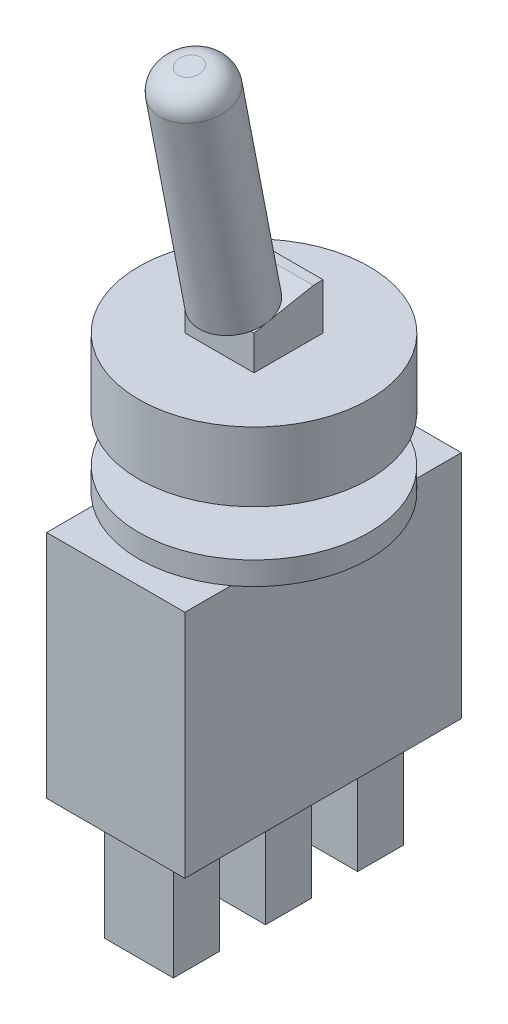
ISO-10303-21;
HEADER;
FILE_DESCRIPTION(('STEP AP214'),'2;1');
FILE_NAME('part.step','',(''),(''),'','','');
FILE_SCHEMA(('AUTOMOTIVE_DESIGN { 1 0 10303 214 1 1 1 1 }'));
ENDSEC;
DATA;
#1=APPLICATION_CONTEXT('core data for automotive mechanical design processes');
#2=APPLICATION_PROTOCOL_DEFINITION('international standard','automotive_design',2000,#1);
#3=PRODUCT_CONTEXT('',#1,'mechanical');
#4=PRODUCT('Part','Part','',(#3));
#5=PRODUCT_RELATED_PRODUCT_CATEGORY('part','',(#4));
#6=PRODUCT_DEFINITION_FORMATION('','',#4);
#7=PRODUCT_DEFINITION_CONTEXT('part definition',#1,'design');
#8=PRODUCT_DEFINITION('design','',#6,#7);
#9=PRODUCT_DEFINITION_SHAPE('','',#8);
#10=(LENGTH_UNIT() NAMED_UNIT(*) SI_UNIT(.MILLI.,.METRE.));
#11=(NAMED_UNIT(*) PLANE_ANGLE_UNIT() SI_UNIT($,.RADIAN.));
#12=(NAMED_UNIT(*) SI_UNIT($,.STERADIAN.) SOLID_ANGLE_UNIT());
#13=UNCERTAINTY_MEASURE_WITH_UNIT(LENGTH_MEASURE(1.E-05),#10,'distance_accuracy_value','');
#14=(GEOMETRIC_REPRESENTATION_CONTEXT(3) GLOBAL_UNCERTAINTY_ASSIGNED_CONTEXT((#13)) GLOBAL_UNIT_ASSIGNED_CONTEXT((#10,
#11,#12)) REPRESENTATION_CONTEXT('',''));
#15=CARTESIAN_POINT('',(0.,0.,0.));
#16=DIRECTION('',(0.,0.,1.));
#17=DIRECTION('',(1.,0.,0.));
#18=AXIS2_PLACEMENT_3D('',#15,#16,#17);
#19=CARTESIAN_POINT('',(-1.5,5.,-1.07227700798515));
#20=DIRECTION('',(0.,0.981627183447664,0.190808995376545));
#21=DIRECTION('',(0.,-0.190808995376545,0.981627183447664));
#22=AXIS2_PLACEMENT_3D('',#19,#20,#21);
#23=PLANE('',#22);
#24=CARTESIAN_POINT('',(0.,4.61711861783721,0.897476944260715));
#25=DIRECTION('',(0.,0.981627183447664,0.190808995376545));
#26=DIRECTION('',(0.,-0.190808995376545,0.981627183447664));
#27=AXIS2_PLACEMENT_3D('',#24,#25,#26);
#28=CIRCLE('',#27,1.5);
#29=CARTESIAN_POINT('',(1.36866694146476,4.5,1.5));
#30=VERTEX_POINT('',#29);
#31=CARTESIAN_POINT('',(1.5,4.61711861783721,0.897476944260715));
#32=VERTEX_POINT('',#31);
#33=EDGE_CURVE('E52',#30,#32,#28,.T.);
#34=ORIENTED_EDGE('',*,*,#33,.F.);
#35=DIRECTION('',(-1.,0.,0.));
#36=VECTOR('',#35,1.);
#37=CARTESIAN_POINT('',(-1.5,4.5,1.5));
#38=LINE('',#37,#36);
#39=CARTESIAN_POINT('',(1.5,4.5,1.5));
#40=VERTEX_POINT('',#39);
#41=EDGE_CURVE('E204',#40,#30,#38,.T.);
#42=ORIENTED_EDGE('',*,*,#41,.F.);
#43=DIRECTION('',(0.,-0.190808995376545,0.981627183447664));
#44=VECTOR('',#43,1.);
#45=CARTESIAN_POINT('',(1.5,5.,-1.07227700798515));
#46=LINE('',#45,#44);
#47=EDGE_CURVE('E400',#32,#40,#46,.T.);
#48=ORIENTED_EDGE('',*,*,#47,.F.);
#49=EDGE_LOOP('',(#34,#42,#48));
#50=FACE_BOUND('',#49,.T.);
#51=ADVANCED_FACE('F30',(#50),#23,.T.);
#52=CARTESIAN_POINT('',(-1.5,4.61711861783721,0.897476944260715));
#53=VERTEX_POINT('',#52);
#54=EDGE_CURVE('E45',#32,#53,#28,.T.);
#55=ORIENTED_EDGE('',*,*,#54,.F.);
#56=CARTESIAN_POINT('',(1.5,5.,-1.07227700798515));
#57=VERTEX_POINT('',#56);
#58=EDGE_CURVE('E216',#57,#32,#46,.T.);
#59=ORIENTED_EDGE('',*,*,#58,.F.);
#60=DIRECTION('',(1.,0.,0.));
#61=VECTOR('',#60,1.);
#62=CARTESIAN_POINT('',(1.5,5.,-1.07227700798515));
#63=LINE('',#62,#61);
#64=CARTESIAN_POINT('',(-1.5,5.,-1.07227700798515));
#65=VERTEX_POINT('',#64);
#66=EDGE_CURVE('E397',#65,#57,#63,.T.);
#67=ORIENTED_EDGE('',*,*,#66,.F.);
#68=DIRECTION('',(0.,0.190808995376545,-0.981627183447664));
#69=VECTOR('',#68,1.);
#70=CARTESIAN_POINT('',(-1.5,5.,-1.07227700798515));
#71=LINE('',#70,#69);
#72=EDGE_CURVE('E222',#53,#65,#71,.T.);
#73=ORIENTED_EDGE('',*,*,#72,.F.);
#74=EDGE_LOOP('',(#55,#59,#67,#73));
#75=FACE_BOUND('',#74,.T.);
#76=ADVANCED_FACE('F417',(#75),#23,.T.);
#77=CARTESIAN_POINT('',(0.,3.,0.));
#78=DIRECTION('',(0.,1.,0.));
#79=DIRECTION('',(0.,0.,1.));
#80=AXIS2_PLACEMENT_3D('',#77,#78,#79);
#81=PLANE('',#80);
#82=CARTESIAN_POINT('',(0.,3.,0.));
#83=DIRECTION('',(0.,1.,0.));
#84=DIRECTION('',(0.,0.,1.));
#85=AXIS2_PLACEMENT_3D('',#82,#83,#84);
#86=CIRCLE('',#85,5.);
#87=CARTESIAN_POINT('',(0.,3.,5.));
#88=VERTEX_POINT('',#87);
#89=EDGE_CURVE('E391',#88,#88,#86,.T.);
#90=ORIENTED_EDGE('',*,*,#89,.T.);
#91=EDGE_LOOP('',(#90));
#92=FACE_BOUND('',#91,.T.);
#93=DIRECTION('',(1.,0.,0.));
#94=VECTOR('',#93,1.);
#95=CARTESIAN_POINT('',(-1.5,3.,1.5));
#96=LINE('',#95,#94);
#97=CARTESIAN_POINT('',(-1.5,3.,1.5));
#98=VERTEX_POINT('',#97);
#99=CARTESIAN_POINT('',(1.5,3.,1.5));
#100=VERTEX_POINT('',#99);
#101=EDGE_CURVE('E227',#98,#100,#96,.T.);
#102=ORIENTED_EDGE('',*,*,#101,.F.);
#103=DIRECTION('',(0.,0.,1.));
#104=VECTOR('',#103,1.);
#105=CARTESIAN_POINT('',(-1.5,3.,-1.5));
#106=LINE('',#105,#104);
#107=CARTESIAN_POINT('',(-1.5,3.,-1.5));
#108=VERTEX_POINT('',#107);
#109=EDGE_CURVE('E225',#108,#98,#106,.T.);
#110=ORIENTED_EDGE('',*,*,#109,.F.);
#111=DIRECTION('',(-1.,0.,0.));
#112=VECTOR('',#111,1.);
#113=CARTESIAN_POINT('',(-1.5,3.,-1.5));
#114=LINE('',#113,#112);
#115=CARTESIAN_POINT('',(1.5,3.,-1.5));
#116=VERTEX_POINT('',#115);
#117=EDGE_CURVE('E238',#116,#108,#114,.T.);
#118=ORIENTED_EDGE('',*,*,#117,.F.);
#119=DIRECTION('',(0.,0.,-1.));
#120=VECTOR('',#119,1.);
#121=CARTESIAN_POINT('',(1.5,3.,-1.5));
#122=LINE('',#121,#120);
#123=EDGE_CURVE('E233',#100,#116,#122,.T.);
#124=ORIENTED_EDGE('',*,*,#123,.F.);
#125=EDGE_LOOP('',(#102,#110,#118,#124));
#126=FACE_BOUND('',#125,.T.);
#127=ADVANCED_FACE('F422',(#92,#126),#81,.T.);
#128=CARTESIAN_POINT('',(3.,-13.,-6.));
#129=DIRECTION('',(0.,-1.,0.));
#130=DIRECTION('',(0.,0.,-1.));
#131=AXIS2_PLACEMENT_3D('',#128,#129,#130);
#132=PLANE('',#131);
#133=DIRECTION('',(1.,0.,0.));
#134=VECTOR('',#133,1.);
#135=CARTESIAN_POINT('',(-1.5,-13.,-1.));
#136=LINE('',#135,#134);
#137=CARTESIAN_POINT('',(-1.5,-13.,-1.));
#138=VERTEX_POINT('',#137);
#139=CARTESIAN_POINT('',(1.5,-13.,-1.));
#140=VERTEX_POINT('',#139);
#141=EDGE_CURVE('E287',#138,#140,#136,.T.);
#142=ORIENTED_EDGE('',*,*,#141,.F.);
#143=DIRECTION('',(0.,0.,-1.));
#144=VECTOR('',#143,1.);
#145=CARTESIAN_POINT('',(-1.5,-13.,-1.));
#146=LINE('',#145,#144);
#147=CARTESIAN_POINT('',(-1.5,-13.,1.));
#148=VERTEX_POINT('',#147);
#149=EDGE_CURVE('E284',#148,#138,#146,.T.);
#150=ORIENTED_EDGE('',*,*,#149,.F.);
#151=DIRECTION('',(-1.,0.,0.));
#152=VECTOR('',#151,1.);
#153=CARTESIAN_POINT('',(-1.5,-13.,1.));
#154=LINE('',#153,#152);
#155=CARTESIAN_POINT('',(1.5,-13.,1.));
#156=VERTEX_POINT('',#155);
#157=EDGE_CURVE('E292',#156,#148,#154,.T.);
#158=ORIENTED_EDGE('',*,*,#157,.F.);
#159=DIRECTION('',(0.,0.,1.));
#160=VECTOR('',#159,1.);
#161=CARTESIAN_POINT('',(1.5,-13.,-1.));
#162=LINE('',#161,#160);
#163=EDGE_CURVE('E289',#140,#156,#162,.T.);
#164=ORIENTED_EDGE('',*,*,#163,.F.);
#165=EDGE_LOOP('',(#142,#150,#158,#164));
#166=FACE_BOUND('',#165,.T.);
#167=DIRECTION('',(0.,0.,1.));
#168=VECTOR('',#167,1.);
#169=CARTESIAN_POINT('',(3.,-13.,-6.));
#170=LINE('',#169,#168);
#171=CARTESIAN_POINT('',(3.,-13.,-6.));
#172=VERTEX_POINT('',#171);
#173=CARTESIAN_POINT('',(3.,-13.,6.));
#174=VERTEX_POINT('',#173);
#175=EDGE_CURVE('E356',#172,#174,#170,.T.);
#176=ORIENTED_EDGE('',*,*,#175,.T.);
#177=DIRECTION('',(-1.,0.,0.));
#178=VECTOR('',#177,1.);
#179=CARTESIAN_POINT('',(3.,-13.,6.));
#180=LINE('',#179,#178);
#181=CARTESIAN_POINT('',(-3.,-13.,6.));
#182=VERTEX_POINT('',#181);
#183=EDGE_CURVE('E359',#174,#182,#180,.T.);
#184=ORIENTED_EDGE('',*,*,#183,.T.);
#185=DIRECTION('',(0.,0.,-1.));
#186=VECTOR('',#185,1.);
#187=CARTESIAN_POINT('',(-3.,-13.,-6.));
#188=LINE('',#187,#186);
#189=CARTESIAN_POINT('',(-3.,-13.,-6.));
#190=VERTEX_POINT('',#189);
#191=EDGE_CURVE('E361',#182,#190,#188,.T.);
#192=ORIENTED_EDGE('',*,*,#191,.T.);
#193=DIRECTION('',(1.,0.,0.));
#194=VECTOR('',#193,1.);
#195=CARTESIAN_POINT('',(3.,-13.,-6.));
#196=LINE('',#195,#194);
#197=EDGE_CURVE('E363',#190,#172,#196,.T.);
#198=ORIENTED_EDGE('',*,*,#197,.T.);
#199=EDGE_LOOP('',(#176,#184,#192,#198));
#200=FACE_BOUND('',#199,.T.);
#201=DIRECTION('',(1.,0.,0.));
#202=VECTOR('',#201,1.);
#203=CARTESIAN_POINT('',(-1.5,-13.,3.));
#204=LINE('',#203,#202);
#205=CARTESIAN_POINT('',(-1.5,-13.,3.));
#206=VERTEX_POINT('',#205);
#207=CARTESIAN_POINT('',(1.5,-13.,3.));
#208=VERTEX_POINT('',#207);
#209=EDGE_CURVE('E316',#206,#208,#204,.T.);
#210=ORIENTED_EDGE('',*,*,#209,.F.);
#211=DIRECTION('',(0.,0.,-1.));
#212=VECTOR('',#211,1.);
#213=CARTESIAN_POINT('',(-1.5,-13.,3.));
#214=LINE('',#213,#212);
#215=CARTESIAN_POINT('',(-1.5,-13.,5.));
#216=VERTEX_POINT('',#215);
#217=EDGE_CURVE('E313',#216,#206,#214,.T.);
#218=ORIENTED_EDGE('',*,*,#217,.F.);
#219=DIRECTION('',(-1.,0.,0.));
#220=VECTOR('',#219,1.);
#221=CARTESIAN_POINT('',(-1.5,-13.,5.));
#222=LINE('',#221,#220);
#223=CARTESIAN_POINT('',(1.5,-13.,5.));
#224=VERTEX_POINT('',#223);
#225=EDGE_CURVE('E321',#224,#216,#222,.T.);
#226=ORIENTED_EDGE('',*,*,#225,.F.);
#227=DIRECTION('',(0.,0.,1.));
#228=VECTOR('',#227,1.);
#229=CARTESIAN_POINT('',(1.5,-13.,3.));
#230=LINE('',#229,#228);
#231=EDGE_CURVE('E318',#208,#224,#230,.T.);
#232=ORIENTED_EDGE('',*,*,#231,.F.);
#233=EDGE_LOOP('',(#210,#218,#226,#232));
#234=FACE_BOUND('',#233,.T.);
#235=DIRECTION('',(1.,0.,0.));
#236=VECTOR('',#235,1.);
#237=CARTESIAN_POINT('',(-1.5,-13.,-5.));
#238=LINE('',#237,#236);
#239=CARTESIAN_POINT('',(-1.5,-13.,-5.));
#240=VERTEX_POINT('',#239);
#241=CARTESIAN_POINT('',(1.5,-13.,-5.));
#242=VERTEX_POINT('',#241);
#243=EDGE_CURVE('E258',#240,#242,#238,.T.);
#244=ORIENTED_EDGE('',*,*,#243,.F.);
#245=DIRECTION('',(0.,0.,-1.));
#246=VECTOR('',#245,1.);
#247=CARTESIAN_POINT('',(-1.5,-13.,-5.));
#248=LINE('',#247,#246);
#249=CARTESIAN_POINT('',(-1.5,-13.,-3.));
#250=VERTEX_POINT('',#249);
#251=EDGE_CURVE('E255',#250,#240,#248,.T.);
#252=ORIENTED_EDGE('',*,*,#251,.F.);
#253=DIRECTION('',(-1.,0.,0.));
#254=VECTOR('',#253,1.);
#255=CARTESIAN_POINT('',(-1.5,-13.,-3.));
#256=LINE('',#255,#254);
#257=CARTESIAN_POINT('',(1.5,-13.,-3.));
#258=VERTEX_POINT('',#257);
#259=EDGE_CURVE('E263',#258,#250,#256,.T.);
#260=ORIENTED_EDGE('',*,*,#259,.F.);
#261=DIRECTION('',(0.,0.,1.));
#262=VECTOR('',#261,1.);
#263=CARTESIAN_POINT('',(1.5,-13.,-5.));
#264=LINE('',#263,#262);
#265=EDGE_CURVE('E260',#242,#258,#264,.T.);
#266=ORIENTED_EDGE('',*,*,#265,.F.);
#267=EDGE_LOOP('',(#244,#252,#260,#266));
#268=FACE_BOUND('',#267,.T.);
#269=ADVANCED_FACE('F516',(#166,#200,#234,#268),#132,.T.);
#270=CARTESIAN_POINT('',(0.,-3.,0.));
#271=DIRECTION('',(0.,-1.,0.));
#272=DIRECTION('',(0.,0.,-1.));
#273=AXIS2_PLACEMENT_3D('',#270,#271,#272);
#274=PLANE('',#273);
#275=DIRECTION('',(0.,0.,1.));
#276=VECTOR('',#275,1.);
#277=CARTESIAN_POINT('',(3.,-3.,-6.));
#278=LINE('',#277,#276);
#279=CARTESIAN_POINT('',(3.,-3.,-4.));
#280=VERTEX_POINT('',#279);
#281=CARTESIAN_POINT('',(3.,-3.,4.));
#282=VERTEX_POINT('',#281);
#283=EDGE_CURVE('E347',#280,#282,#278,.T.);
#284=ORIENTED_EDGE('',*,*,#283,.F.);
#285=CARTESIAN_POINT('',(0.,-3.,0.));
#286=DIRECTION('',(0.,-1.,0.));
#287=DIRECTION('',(0.,0.,-1.));
#288=AXIS2_PLACEMENT_3D('',#285,#286,#287);
#289=CIRCLE('',#288,5.);
#290=EDGE_CURVE('E381',#280,#282,#289,.T.);
#291=ORIENTED_EDGE('',*,*,#290,.T.);
#292=EDGE_LOOP('',(#284,#291));
#293=FACE_BOUND('',#292,.T.);
#294=ADVANCED_FACE('F519',(#293),#274,.T.);
#295=CARTESIAN_POINT('',(0.,0.,0.));
#296=DIRECTION('',(0.,1.,0.));
#297=DIRECTION('',(0.,0.,1.));
#298=AXIS2_PLACEMENT_3D('',#295,#296,#297);
#299=PLANE('',#298);
#300=CARTESIAN_POINT('',(0.,0.,0.));
#301=DIRECTION('',(0.,1.,0.));
#302=DIRECTION('',(0.,0.,1.));
#303=AXIS2_PLACEMENT_3D('',#300,#301,#302);
#304=CIRCLE('',#303,5.);
#305=CARTESIAN_POINT('',(0.,0.,5.));
#306=VERTEX_POINT('',#305);
#307=EDGE_CURVE('E388',#306,#306,#304,.T.);
#308=ORIENTED_EDGE('',*,*,#307,.F.);
#309=EDGE_LOOP('',(#308));
#310=FACE_BOUND('',#309,.T.);
#311=CARTESIAN_POINT('',(0.,0.,0.));
#312=DIRECTION('',(0.,1.,0.));
#313=DIRECTION('',(0.,0.,1.));
#314=AXIS2_PLACEMENT_3D('',#311,#312,#313);
#315=CIRCLE('',#314,2.);
#316=CARTESIAN_POINT('',(0.,0.,2.));
#317=VERTEX_POINT('',#316);
#318=EDGE_CURVE('E394',#317,#317,#315,.F.);
#319=ORIENTED_EDGE('',*,*,#318,.F.);
#320=EDGE_LOOP('',(#319));
#321=FACE_BOUND('',#320,.T.);
#322=ADVANCED_FACE('F551',(#310,#321),#299,.F.);
#323=CARTESIAN_POINT('',(0.,3.,0.));
#324=DIRECTION('',(0.,-1.,0.));
#325=DIRECTION('',(0.,0.,-1.));
#326=AXIS2_PLACEMENT_3D('',#323,#324,#325);
#327=CYLINDRICAL_SURFACE('',#326,5.);
#328=ORIENTED_EDGE('',*,*,#89,.F.);
#329=EDGE_LOOP('',(#328));
#330=FACE_BOUND('',#329,.T.);
#331=ORIENTED_EDGE('',*,*,#307,.T.);
#332=EDGE_LOOP('',(#331));
#333=FACE_BOUND('',#332,.T.);
#334=ADVANCED_FACE('F32',(#330,#333),#327,.T.);
#335=CARTESIAN_POINT('',(0.,-2.,0.));
#336=DIRECTION('',(0.,1.,0.));
#337=DIRECTION('',(0.,0.,1.));
#338=AXIS2_PLACEMENT_3D('',#335,#336,#337);
#339=CYLINDRICAL_SURFACE('',#338,2.);
#340=CARTESIAN_POINT('',(0.,-2.,0.));
#341=DIRECTION('',(0.,-1.,0.));
#342=DIRECTION('',(0.,0.,-1.));
#343=AXIS2_PLACEMENT_3D('',#340,#341,#342);
#344=CIRCLE('',#343,2.);
#345=CARTESIAN_POINT('',(0.,-2.,-2.));
#346=VERTEX_POINT('',#345);
#347=EDGE_CURVE('E384',#346,#346,#344,.T.);
#348=ORIENTED_EDGE('',*,*,#347,.F.);
#349=EDGE_LOOP('',(#348));
#350=FACE_BOUND('',#349,.T.);
#351=ORIENTED_EDGE('',*,*,#318,.T.);
#352=EDGE_LOOP('',(#351));
#353=FACE_BOUND('',#352,.T.);
#354=ADVANCED_FACE('F540',(#350,#353),#339,.T.);
#355=CARTESIAN_POINT('',(0.,-2.,0.));
#356=DIRECTION('',(0.,-1.,0.));
#357=DIRECTION('',(0.,0.,-1.));
#358=AXIS2_PLACEMENT_3D('',#355,#356,#357);
#359=PLANE('',#358);
#360=CARTESIAN_POINT('',(0.,-2.,0.));
#361=DIRECTION('',(0.,-1.,0.));
#362=DIRECTION('',(0.,0.,-1.));
#363=AXIS2_PLACEMENT_3D('',#360,#361,#362);
#364=CIRCLE('',#363,5.);
#365=CARTESIAN_POINT('',(0.,-2.,-5.));
#366=VERTEX_POINT('',#365);
#367=EDGE_CURVE('E377',#366,#366,#364,.T.);
#368=ORIENTED_EDGE('',*,*,#367,.F.);
#369=EDGE_LOOP('',(#368));
#370=FACE_BOUND('',#369,.T.);
#371=ORIENTED_EDGE('',*,*,#347,.T.);
#372=EDGE_LOOP('',(#371));
#373=FACE_BOUND('',#372,.T.);
#374=ADVANCED_FACE('F536',(#370,#373),#359,.F.);
#375=CARTESIAN_POINT('',(0.,-3.,0.));
#376=DIRECTION('',(0.,1.,0.));
#377=DIRECTION('',(0.,0.,1.));
#378=AXIS2_PLACEMENT_3D('',#375,#376,#377);
#379=CYLINDRICAL_SURFACE('',#378,5.);
#380=ORIENTED_EDGE('',*,*,#290,.F.);
#381=CARTESIAN_POINT('',(-3.,-3.,-4.));
#382=VERTEX_POINT('',#381);
#383=EDGE_CURVE('E380',#382,#280,#289,.T.);
#384=ORIENTED_EDGE('',*,*,#383,.F.);
#385=CARTESIAN_POINT('',(-3.,-3.,4.));
#386=VERTEX_POINT('',#385);
#387=EDGE_CURVE('E835',#386,#382,#289,.T.);
#388=ORIENTED_EDGE('',*,*,#387,.F.);
#389=EDGE_CURVE('E385',#282,#386,#289,.T.);
#390=ORIENTED_EDGE('',*,*,#389,.F.);
#391=EDGE_LOOP('',(#380,#384,#388,#390));
#392=FACE_BOUND('',#391,.T.);
#393=ORIENTED_EDGE('',*,*,#367,.T.);
#394=EDGE_LOOP('',(#393));
#395=FACE_BOUND('',#394,.T.);
#396=ADVANCED_FACE('F539',(#392,#395),#379,.T.);
#397=DIRECTION('',(0.,0.,-1.));
#398=VECTOR('',#397,1.);
#399=CARTESIAN_POINT('',(-3.,-3.,-6.));
#400=LINE('',#399,#398);
#401=EDGE_CURVE('E354',#386,#382,#400,.T.);
#402=ORIENTED_EDGE('',*,*,#401,.F.);
#403=ORIENTED_EDGE('',*,*,#387,.T.);
#404=EDGE_LOOP('',(#402,#403));
#405=FACE_BOUND('',#404,.T.);
#406=ADVANCED_FACE('F514',(#405),#274,.T.);
#407=CARTESIAN_POINT('',(3.,-3.,-6.));
#408=DIRECTION('',(0.,-1.,0.));
#409=DIRECTION('',(0.,0.,-1.));
#410=AXIS2_PLACEMENT_3D('',#407,#408,#409);
#411=PLANE('',#410);
#412=CARTESIAN_POINT('',(3.,-3.,6.));
#413=VERTEX_POINT('',#412);
#414=EDGE_CURVE('E342',#282,#413,#278,.T.);
#415=ORIENTED_EDGE('',*,*,#414,.F.);
#416=ORIENTED_EDGE('',*,*,#389,.T.);
#417=CARTESIAN_POINT('',(-3.,-3.,6.));
#418=VERTEX_POINT('',#417);
#419=EDGE_CURVE('E350',#418,#386,#400,.T.);
#420=ORIENTED_EDGE('',*,*,#419,.F.);
#421=DIRECTION('',(-1.,0.,0.));
#422=VECTOR('',#421,1.);
#423=CARTESIAN_POINT('',(3.,-3.,6.));
#424=LINE('',#423,#422);
#425=EDGE_CURVE('E346',#413,#418,#424,.T.);
#426=ORIENTED_EDGE('',*,*,#425,.F.);
#427=EDGE_LOOP('',(#415,#416,#420,#426));
#428=FACE_BOUND('',#427,.T.);
#429=ADVANCED_FACE('F510',(#428),#411,.F.);
#430=CARTESIAN_POINT('',(-3.,-3.,-6.));
#431=VERTEX_POINT('',#430);
#432=EDGE_CURVE('E349',#382,#431,#400,.T.);
#433=ORIENTED_EDGE('',*,*,#432,.F.);
#434=ORIENTED_EDGE('',*,*,#383,.T.);
#435=CARTESIAN_POINT('',(3.,-3.,-6.));
#436=VERTEX_POINT('',#435);
#437=EDGE_CURVE('E343',#436,#280,#278,.T.);
#438=ORIENTED_EDGE('',*,*,#437,.F.);
#439=DIRECTION('',(1.,0.,0.));
#440=VECTOR('',#439,1.);
#441=CARTESIAN_POINT('',(3.,-3.,-6.));
#442=LINE('',#441,#440);
#443=EDGE_CURVE('E353',#431,#436,#442,.T.);
#444=ORIENTED_EDGE('',*,*,#443,.F.);
#445=EDGE_LOOP('',(#433,#434,#438,#444));
#446=FACE_BOUND('',#445,.T.);
#447=ADVANCED_FACE('F513',(#446),#411,.F.);
#448=CARTESIAN_POINT('',(3.,-13.,-6.));
#449=DIRECTION('',(-1.,0.,0.));
#450=DIRECTION('',(0.,0.,1.));
#451=AXIS2_PLACEMENT_3D('',#448,#449,#450);
#452=PLANE('',#451);
#453=ORIENTED_EDGE('',*,*,#437,.T.);
#454=ORIENTED_EDGE('',*,*,#283,.T.);
#455=ORIENTED_EDGE('',*,*,#414,.T.);
#456=DIRECTION('',(0.,1.,0.));
#457=VECTOR('',#456,1.);
#458=CARTESIAN_POINT('',(3.,-13.,6.));
#459=LINE('',#458,#457);
#460=EDGE_CURVE('E374',#174,#413,#459,.T.);
#461=ORIENTED_EDGE('',*,*,#460,.F.);
#462=ORIENTED_EDGE('',*,*,#175,.F.);
#463=DIRECTION('',(0.,1.,0.));
#464=VECTOR('',#463,1.);
#465=CARTESIAN_POINT('',(3.,-13.,-6.));
#466=LINE('',#465,#464);
#467=EDGE_CURVE('E365',#172,#436,#466,.T.);
#468=ORIENTED_EDGE('',*,*,#467,.T.);
#469=EDGE_LOOP('',(#453,#454,#455,#461,#462,#468));
#470=FACE_BOUND('',#469,.T.);
#471=ADVANCED_FACE('F531',(#470),#452,.F.);
#472=CARTESIAN_POINT('',(3.,-13.,6.));
#473=DIRECTION('',(0.,0.,-1.));
#474=DIRECTION('',(-1.,0.,0.));
#475=AXIS2_PLACEMENT_3D('',#472,#473,#474);
#476=PLANE('',#475);
#477=ORIENTED_EDGE('',*,*,#425,.T.);
#478=DIRECTION('',(0.,1.,0.));
#479=VECTOR('',#478,1.);
#480=CARTESIAN_POINT('',(-3.,-13.,6.));
#481=LINE('',#480,#479);
#482=EDGE_CURVE('E371',#182,#418,#481,.T.);
#483=ORIENTED_EDGE('',*,*,#482,.F.);
#484=ORIENTED_EDGE('',*,*,#183,.F.);
#485=ORIENTED_EDGE('',*,*,#460,.T.);
#486=EDGE_LOOP('',(#477,#483,#484,#485));
#487=FACE_BOUND('',#486,.T.);
#488=ADVANCED_FACE('F527',(#487),#476,.F.);
#489=CARTESIAN_POINT('',(-3.,-13.,-6.));
#490=DIRECTION('',(1.,0.,0.));
#491=DIRECTION('',(0.,0.,-1.));
#492=AXIS2_PLACEMENT_3D('',#489,#490,#491);
#493=PLANE('',#492);
#494=ORIENTED_EDGE('',*,*,#419,.T.);
#495=ORIENTED_EDGE('',*,*,#401,.T.);
#496=ORIENTED_EDGE('',*,*,#432,.T.);
#497=DIRECTION('',(0.,1.,0.));
#498=VECTOR('',#497,1.);
#499=CARTESIAN_POINT('',(-3.,-13.,-6.));
#500=LINE('',#499,#498);
#501=EDGE_CURVE('E368',#190,#431,#500,.T.);
#502=ORIENTED_EDGE('',*,*,#501,.F.);
#503=ORIENTED_EDGE('',*,*,#191,.F.);
#504=ORIENTED_EDGE('',*,*,#482,.T.);
#505=EDGE_LOOP('',(#494,#495,#496,#502,#503,#504));
#506=FACE_BOUND('',#505,.T.);
#507=ADVANCED_FACE('F523',(#506),#493,.F.);
#508=CARTESIAN_POINT('',(3.,-13.,-6.));
#509=DIRECTION('',(0.,0.,1.));
#510=DIRECTION('',(1.,0.,0.));
#511=AXIS2_PLACEMENT_3D('',#508,#509,#510);
#512=PLANE('',#511);
#513=ORIENTED_EDGE('',*,*,#443,.T.);
#514=ORIENTED_EDGE('',*,*,#467,.F.);
#515=ORIENTED_EDGE('',*,*,#197,.F.);
#516=ORIENTED_EDGE('',*,*,#501,.T.);
#517=EDGE_LOOP('',(#513,#514,#515,#516));
#518=FACE_BOUND('',#517,.T.);
#519=ADVANCED_FACE('F508',(#518),#512,.F.);
#520=CARTESIAN_POINT('',(-1.5,-18.,3.));
#521=DIRECTION('',(1.,0.,0.));
#522=DIRECTION('',(0.,0.,-1.));
#523=AXIS2_PLACEMENT_3D('',#520,#521,#522);
#524=PLANE('',#523);
#525=ORIENTED_EDGE('',*,*,#217,.T.);
#526=DIRECTION('',(0.,1.,0.));
#527=VECTOR('',#526,1.);
#528=CARTESIAN_POINT('',(-1.5,-18.,3.));
#529=LINE('',#528,#527);
#530=CARTESIAN_POINT('',(-1.5,-18.,3.));
#531=VERTEX_POINT('',#530);
#532=EDGE_CURVE('E340',#531,#206,#529,.T.);
#533=ORIENTED_EDGE('',*,*,#532,.F.);
#534=DIRECTION('',(0.,0.,-1.));
#535=VECTOR('',#534,1.);
#536=CARTESIAN_POINT('',(-1.5,-18.,3.));
#537=LINE('',#536,#535);
#538=CARTESIAN_POINT('',(-1.5,-18.,5.));
#539=VERTEX_POINT('',#538);
#540=EDGE_CURVE('E323',#539,#531,#537,.T.);
#541=ORIENTED_EDGE('',*,*,#540,.F.);
#542=DIRECTION('',(0.,1.,0.));
#543=VECTOR('',#542,1.);
#544=CARTESIAN_POINT('',(-1.5,-18.,5.));
#545=LINE('',#544,#543);
#546=EDGE_CURVE('E332',#539,#216,#545,.T.);
#547=ORIENTED_EDGE('',*,*,#546,.T.);
#548=EDGE_LOOP('',(#525,#533,#541,#547));
#549=FACE_BOUND('',#548,.T.);
#550=ADVANCED_FACE('F504',(#549),#524,.F.);
#551=CARTESIAN_POINT('',(-1.5,-18.,3.));
#552=DIRECTION('',(0.,0.,1.));
#553=DIRECTION('',(1.,0.,0.));
#554=AXIS2_PLACEMENT_3D('',#551,#552,#553);
#555=PLANE('',#554);
#556=ORIENTED_EDGE('',*,*,#209,.T.);
#557=DIRECTION('',(0.,1.,0.));
#558=VECTOR('',#557,1.);
#559=CARTESIAN_POINT('',(1.5,-18.,3.));
#560=LINE('',#559,#558);
#561=CARTESIAN_POINT('',(1.5,-18.,3.));
#562=VERTEX_POINT('',#561);
#563=EDGE_CURVE('E337',#562,#208,#560,.T.);
#564=ORIENTED_EDGE('',*,*,#563,.F.);
#565=DIRECTION('',(1.,0.,0.));
#566=VECTOR('',#565,1.);
#567=CARTESIAN_POINT('',(-1.5,-18.,3.));
#568=LINE('',#567,#566);
#569=EDGE_CURVE('E326',#531,#562,#568,.T.);
#570=ORIENTED_EDGE('',*,*,#569,.F.);
#571=ORIENTED_EDGE('',*,*,#532,.T.);
#572=EDGE_LOOP('',(#556,#564,#570,#571));
#573=FACE_BOUND('',#572,.T.);
#574=ADVANCED_FACE('F500',(#573),#555,.F.);
#575=CARTESIAN_POINT('',(1.5,-18.,3.));
#576=DIRECTION('',(-1.,0.,0.));
#577=DIRECTION('',(0.,0.,1.));
#578=AXIS2_PLACEMENT_3D('',#575,#576,#577);
#579=PLANE('',#578);
#580=ORIENTED_EDGE('',*,*,#231,.T.);
#581=DIRECTION('',(0.,1.,0.));
#582=VECTOR('',#581,1.);
#583=CARTESIAN_POINT('',(1.5,-18.,5.));
#584=LINE('',#583,#582);
#585=CARTESIAN_POINT('',(1.5,-18.,5.));
#586=VERTEX_POINT('',#585);
#587=EDGE_CURVE('E335',#586,#224,#584,.T.);
#588=ORIENTED_EDGE('',*,*,#587,.F.);
#589=DIRECTION('',(0.,0.,1.));
#590=VECTOR('',#589,1.);
#591=CARTESIAN_POINT('',(1.5,-18.,3.));
#592=LINE('',#591,#590);
#593=EDGE_CURVE('E328',#562,#586,#592,.T.);
#594=ORIENTED_EDGE('',*,*,#593,.F.);
#595=ORIENTED_EDGE('',*,*,#563,.T.);
#596=EDGE_LOOP('',(#580,#588,#594,#595));
#597=FACE_BOUND('',#596,.T.);
#598=ADVANCED_FACE('F496',(#597),#579,.F.);
#599=CARTESIAN_POINT('',(-1.5,-18.,5.));
#600=DIRECTION('',(0.,0.,-1.));
#601=DIRECTION('',(-1.,0.,0.));
#602=AXIS2_PLACEMENT_3D('',#599,#600,#601);
#603=PLANE('',#602);
#604=ORIENTED_EDGE('',*,*,#225,.T.);
#605=ORIENTED_EDGE('',*,*,#546,.F.);
#606=DIRECTION('',(-1.,0.,0.));
#607=VECTOR('',#606,1.);
#608=CARTESIAN_POINT('',(-1.5,-18.,5.));
#609=LINE('',#608,#607);
#610=EDGE_CURVE('E330',#586,#539,#609,.T.);
#611=ORIENTED_EDGE('',*,*,#610,.F.);
#612=ORIENTED_EDGE('',*,*,#587,.T.);
#613=EDGE_LOOP('',(#604,#605,#611,#612));
#614=FACE_BOUND('',#613,.T.);
#615=ADVANCED_FACE('F492',(#614),#603,.F.);
#616=CARTESIAN_POINT('',(-1.5,-18.,5.));
#617=DIRECTION('',(0.,1.,0.));
#618=DIRECTION('',(0.,0.,1.));
#619=AXIS2_PLACEMENT_3D('',#616,#617,#618);
#620=PLANE('',#619);
#621=ORIENTED_EDGE('',*,*,#540,.T.);
#622=ORIENTED_EDGE('',*,*,#569,.T.);
#623=ORIENTED_EDGE('',*,*,#593,.T.);
#624=ORIENTED_EDGE('',*,*,#610,.T.);
#625=EDGE_LOOP('',(#621,#622,#623,#624));
#626=FACE_BOUND('',#625,.T.);
#627=ADVANCED_FACE('F488',(#626),#620,.F.);
#628=CARTESIAN_POINT('',(-1.5,-18.,-1.));
#629=DIRECTION('',(1.,0.,0.));
#630=DIRECTION('',(0.,0.,-1.));
#631=AXIS2_PLACEMENT_3D('',#628,#629,#630);
#632=PLANE('',#631);
#633=ORIENTED_EDGE('',*,*,#149,.T.);
#634=DIRECTION('',(0.,1.,0.));
#635=VECTOR('',#634,1.);
#636=CARTESIAN_POINT('',(-1.5,-18.,-1.));
#637=LINE('',#636,#635);
#638=CARTESIAN_POINT('',(-1.5,-18.,-1.));
#639=VERTEX_POINT('',#638);
#640=EDGE_CURVE('E311',#639,#138,#637,.T.);
#641=ORIENTED_EDGE('',*,*,#640,.F.);
#642=DIRECTION('',(0.,0.,-1.));
#643=VECTOR('',#642,1.);
#644=CARTESIAN_POINT('',(-1.5,-18.,-1.));
#645=LINE('',#644,#643);
#646=CARTESIAN_POINT('',(-1.5,-18.,1.));
#647=VERTEX_POINT('',#646);
#648=EDGE_CURVE('E294',#647,#639,#645,.T.);
#649=ORIENTED_EDGE('',*,*,#648,.F.);
#650=DIRECTION('',(0.,1.,0.));
#651=VECTOR('',#650,1.);
#652=CARTESIAN_POINT('',(-1.5,-18.,1.));
#653=LINE('',#652,#651);
#654=EDGE_CURVE('E303',#647,#148,#653,.T.);
#655=ORIENTED_EDGE('',*,*,#654,.T.);
#656=EDGE_LOOP('',(#633,#641,#649,#655));
#657=FACE_BOUND('',#656,.T.);
#658=ADVANCED_FACE('F484',(#657),#632,.F.);
#659=CARTESIAN_POINT('',(-1.5,-18.,-1.));
#660=DIRECTION('',(0.,0.,1.));
#661=DIRECTION('',(1.,0.,0.));
#662=AXIS2_PLACEMENT_3D('',#659,#660,#661);
#663=PLANE('',#662);
#664=ORIENTED_EDGE('',*,*,#141,.T.);
#665=DIRECTION('',(0.,1.,0.));
#666=VECTOR('',#665,1.);
#667=CARTESIAN_POINT('',(1.5,-18.,-1.));
#668=LINE('',#667,#666);
#669=CARTESIAN_POINT('',(1.5,-18.,-1.));
#670=VERTEX_POINT('',#669);
#671=EDGE_CURVE('E308',#670,#140,#668,.T.);
#672=ORIENTED_EDGE('',*,*,#671,.F.);
#673=DIRECTION('',(1.,0.,0.));
#674=VECTOR('',#673,1.);
#675=CARTESIAN_POINT('',(-1.5,-18.,-1.));
#676=LINE('',#675,#674);
#677=EDGE_CURVE('E297',#639,#670,#676,.T.);
#678=ORIENTED_EDGE('',*,*,#677,.F.);
#679=ORIENTED_EDGE('',*,*,#640,.T.);
#680=EDGE_LOOP('',(#664,#672,#678,#679));
#681=FACE_BOUND('',#680,.T.);
#682=ADVANCED_FACE('F480',(#681),#663,.F.);
#683=CARTESIAN_POINT('',(1.5,-18.,-1.));
#684=DIRECTION('',(-1.,0.,0.));
#685=DIRECTION('',(0.,0.,1.));
#686=AXIS2_PLACEMENT_3D('',#683,#684,#685);
#687=PLANE('',#686);
#688=ORIENTED_EDGE('',*,*,#163,.T.);
#689=DIRECTION('',(0.,1.,0.));
#690=VECTOR('',#689,1.);
#691=CARTESIAN_POINT('',(1.5,-18.,1.));
#692=LINE('',#691,#690);
#693=CARTESIAN_POINT('',(1.5,-18.,1.));
#694=VERTEX_POINT('',#693);
#695=EDGE_CURVE('E306',#694,#156,#692,.T.);
#696=ORIENTED_EDGE('',*,*,#695,.F.);
#697=DIRECTION('',(0.,0.,1.));
#698=VECTOR('',#697,1.);
#699=CARTESIAN_POINT('',(1.5,-18.,-1.));
#700=LINE('',#699,#698);
#701=EDGE_CURVE('E299',#670,#694,#700,.T.);
#702=ORIENTED_EDGE('',*,*,#701,.F.);
#703=ORIENTED_EDGE('',*,*,#671,.T.);
#704=EDGE_LOOP('',(#688,#696,#702,#703));
#705=FACE_BOUND('',#704,.T.);
#706=ADVANCED_FACE('F476',(#705),#687,.F.);
#707=CARTESIAN_POINT('',(-1.5,-18.,1.));
#708=DIRECTION('',(0.,0.,-1.));
#709=DIRECTION('',(-1.,0.,0.));
#710=AXIS2_PLACEMENT_3D('',#707,#708,#709);
#711=PLANE('',#710);
#712=ORIENTED_EDGE('',*,*,#157,.T.);
#713=ORIENTED_EDGE('',*,*,#654,.F.);
#714=DIRECTION('',(-1.,0.,0.));
#715=VECTOR('',#714,1.);
#716=CARTESIAN_POINT('',(-1.5,-18.,1.));
#717=LINE('',#716,#715);
#718=EDGE_CURVE('E301',#694,#647,#717,.T.);
#719=ORIENTED_EDGE('',*,*,#718,.F.);
#720=ORIENTED_EDGE('',*,*,#695,.T.);
#721=EDGE_LOOP('',(#712,#713,#719,#720));
#722=FACE_BOUND('',#721,.T.);
#723=ADVANCED_FACE('F472',(#722),#711,.F.);
#724=CARTESIAN_POINT('',(-1.5,-18.,1.));
#725=DIRECTION('',(0.,1.,0.));
#726=DIRECTION('',(0.,0.,1.));
#727=AXIS2_PLACEMENT_3D('',#724,#725,#726);
#728=PLANE('',#727);
#729=ORIENTED_EDGE('',*,*,#648,.T.);
#730=ORIENTED_EDGE('',*,*,#677,.T.);
#731=ORIENTED_EDGE('',*,*,#701,.T.);
#732=ORIENTED_EDGE('',*,*,#718,.T.);
#733=EDGE_LOOP('',(#729,#730,#731,#732));
#734=FACE_BOUND('',#733,.T.);
#735=ADVANCED_FACE('F468',(#734),#728,.F.);
#736=CARTESIAN_POINT('',(-1.5,-18.,-5.));
#737=DIRECTION('',(1.,0.,0.));
#738=DIRECTION('',(0.,0.,-1.));
#739=AXIS2_PLACEMENT_3D('',#736,#737,#738);
#740=PLANE('',#739);
#741=ORIENTED_EDGE('',*,*,#251,.T.);
#742=DIRECTION('',(0.,1.,0.));
#743=VECTOR('',#742,1.);
#744=CARTESIAN_POINT('',(-1.5,-18.,-5.));
#745=LINE('',#744,#743);
#746=CARTESIAN_POINT('',(-1.5,-18.,-5.));
#747=VERTEX_POINT('',#746);
#748=EDGE_CURVE('E282',#747,#240,#745,.T.);
#749=ORIENTED_EDGE('',*,*,#748,.F.);
#750=DIRECTION('',(0.,0.,-1.));
#751=VECTOR('',#750,1.);
#752=CARTESIAN_POINT('',(-1.5,-18.,-5.));
#753=LINE('',#752,#751);
#754=CARTESIAN_POINT('',(-1.5,-18.,-3.));
#755=VERTEX_POINT('',#754);
#756=EDGE_CURVE('E265',#755,#747,#753,.T.);
#757=ORIENTED_EDGE('',*,*,#756,.F.);
#758=DIRECTION('',(0.,1.,0.));
#759=VECTOR('',#758,1.);
#760=CARTESIAN_POINT('',(-1.5,-18.,-3.));
#761=LINE('',#760,#759);
#762=EDGE_CURVE('E274',#755,#250,#761,.T.);
#763=ORIENTED_EDGE('',*,*,#762,.T.);
#764=EDGE_LOOP('',(#741,#749,#757,#763));
#765=FACE_BOUND('',#764,.T.);
#766=ADVANCED_FACE('F464',(#765),#740,.F.);
#767=CARTESIAN_POINT('',(-1.5,-18.,-5.));
#768=DIRECTION('',(0.,0.,1.));
#769=DIRECTION('',(1.,0.,0.));
#770=AXIS2_PLACEMENT_3D('',#767,#768,#769);
#771=PLANE('',#770);
#772=ORIENTED_EDGE('',*,*,#243,.T.);
#773=DIRECTION('',(0.,1.,0.));
#774=VECTOR('',#773,1.);
#775=CARTESIAN_POINT('',(1.5,-18.,-5.));
#776=LINE('',#775,#774);
#777=CARTESIAN_POINT('',(1.5,-18.,-5.));
#778=VERTEX_POINT('',#777);
#779=EDGE_CURVE('E279',#778,#242,#776,.T.);
#780=ORIENTED_EDGE('',*,*,#779,.F.);
#781=DIRECTION('',(1.,0.,0.));
#782=VECTOR('',#781,1.);
#783=CARTESIAN_POINT('',(-1.5,-18.,-5.));
#784=LINE('',#783,#782);
#785=EDGE_CURVE('E268',#747,#778,#784,.T.);
#786=ORIENTED_EDGE('',*,*,#785,.F.);
#787=ORIENTED_EDGE('',*,*,#748,.T.);
#788=EDGE_LOOP('',(#772,#780,#786,#787));
#789=FACE_BOUND('',#788,.T.);
#790=ADVANCED_FACE('F460',(#789),#771,.F.);
#791=CARTESIAN_POINT('',(1.5,-18.,-5.));
#792=DIRECTION('',(-1.,0.,0.));
#793=DIRECTION('',(0.,0.,1.));
#794=AXIS2_PLACEMENT_3D('',#791,#792,#793);
#795=PLANE('',#794);
#796=ORIENTED_EDGE('',*,*,#265,.T.);
#797=DIRECTION('',(0.,1.,0.));
#798=VECTOR('',#797,1.);
#799=CARTESIAN_POINT('',(1.5,-18.,-3.));
#800=LINE('',#799,#798);
#801=CARTESIAN_POINT('',(1.5,-18.,-3.));
#802=VERTEX_POINT('',#801);
#803=EDGE_CURVE('E277',#802,#258,#800,.T.);
#804=ORIENTED_EDGE('',*,*,#803,.F.);
#805=DIRECTION('',(0.,0.,1.));
#806=VECTOR('',#805,1.);
#807=CARTESIAN_POINT('',(1.5,-18.,-5.));
#808=LINE('',#807,#806);
#809=EDGE_CURVE('E270',#778,#802,#808,.T.);
#810=ORIENTED_EDGE('',*,*,#809,.F.);
#811=ORIENTED_EDGE('',*,*,#779,.T.);
#812=EDGE_LOOP('',(#796,#804,#810,#811));
#813=FACE_BOUND('',#812,.T.);
#814=ADVANCED_FACE('F456',(#813),#795,.F.);
#815=CARTESIAN_POINT('',(-1.5,-18.,-3.));
#816=DIRECTION('',(0.,0.,-1.));
#817=DIRECTION('',(-1.,0.,0.));
#818=AXIS2_PLACEMENT_3D('',#815,#816,#817);
#819=PLANE('',#818);
#820=ORIENTED_EDGE('',*,*,#259,.T.);
#821=ORIENTED_EDGE('',*,*,#762,.F.);
#822=DIRECTION('',(-1.,0.,0.));
#823=VECTOR('',#822,1.);
#824=CARTESIAN_POINT('',(-1.5,-18.,-3.));
#825=LINE('',#824,#823);
#826=EDGE_CURVE('E272',#802,#755,#825,.T.);
#827=ORIENTED_EDGE('',*,*,#826,.F.);
#828=ORIENTED_EDGE('',*,*,#803,.T.);
#829=EDGE_LOOP('',(#820,#821,#827,#828));
#830=FACE_BOUND('',#829,.T.);
#831=ADVANCED_FACE('F452',(#830),#819,.F.);
#832=CARTESIAN_POINT('',(-1.5,-18.,-3.));
#833=DIRECTION('',(0.,1.,0.));
#834=DIRECTION('',(0.,0.,1.));
#835=AXIS2_PLACEMENT_3D('',#832,#833,#834);
#836=PLANE('',#835);
#837=ORIENTED_EDGE('',*,*,#756,.T.);
#838=ORIENTED_EDGE('',*,*,#785,.T.);
#839=ORIENTED_EDGE('',*,*,#809,.T.);
#840=ORIENTED_EDGE('',*,*,#826,.T.);
#841=EDGE_LOOP('',(#837,#838,#839,#840));
#842=FACE_BOUND('',#841,.T.);
#843=ADVANCED_FACE('F449',(#842),#836,.F.);
#844=CARTESIAN_POINT('',(-1.5,5.,-1.5));
#845=DIRECTION('',(1.,0.,0.));
#846=DIRECTION('',(0.,0.,-1.));
#847=AXIS2_PLACEMENT_3D('',#844,#845,#846);
#848=PLANE('',#847);
#849=DIRECTION('',(0.,-1.,0.));
#850=VECTOR('',#849,1.);
#851=CARTESIAN_POINT('',(-1.5,5.,1.5));
#852=LINE('',#851,#850);
#853=CARTESIAN_POINT('',(-1.5,4.5,1.5));
#854=VERTEX_POINT('',#853);
#855=EDGE_CURVE('E253',#854,#98,#852,.T.);
#856=ORIENTED_EDGE('',*,*,#855,.F.);
#857=EDGE_CURVE('E215',#854,#53,#71,.T.);
#858=ORIENTED_EDGE('',*,*,#857,.T.);
#859=ORIENTED_EDGE('',*,*,#72,.T.);
#860=DIRECTION('',(0.,0.,1.));
#861=VECTOR('',#860,1.);
#862=CARTESIAN_POINT('',(-1.5,5.,-1.5));
#863=LINE('',#862,#861);
#864=CARTESIAN_POINT('',(-1.5,5.,-1.5));
#865=VERTEX_POINT('',#864);
#866=EDGE_CURVE('E240',#865,#65,#863,.T.);
#867=ORIENTED_EDGE('',*,*,#866,.F.);
#868=DIRECTION('',(0.,-1.,0.));
#869=VECTOR('',#868,1.);
#870=CARTESIAN_POINT('',(-1.5,5.,-1.5));
#871=LINE('',#870,#869);
#872=EDGE_CURVE('E247',#865,#108,#871,.T.);
#873=ORIENTED_EDGE('',*,*,#872,.T.);
#874=ORIENTED_EDGE('',*,*,#109,.T.);
#875=EDGE_LOOP('',(#856,#858,#859,#867,#873,#874));
#876=FACE_BOUND('',#875,.T.);
#877=ADVANCED_FACE('F446',(#876),#848,.F.);
#878=CARTESIAN_POINT('',(-1.5,5.,1.5));
#879=DIRECTION('',(0.,0.,-1.));
#880=DIRECTION('',(-1.,0.,0.));
#881=AXIS2_PLACEMENT_3D('',#878,#879,#880);
#882=PLANE('',#881);
#883=DIRECTION('',(0.,-1.,0.));
#884=VECTOR('',#883,1.);
#885=CARTESIAN_POINT('',(1.5,5.,1.5));
#886=LINE('',#885,#884);
#887=EDGE_CURVE('E251',#40,#100,#886,.T.);
#888=ORIENTED_EDGE('',*,*,#887,.F.);
#889=ORIENTED_EDGE('',*,*,#41,.T.);
#890=CARTESIAN_POINT('',(-1.36866694146476,4.5,1.5));
#891=VERTEX_POINT('',#890);
#892=EDGE_CURVE('E198',#30,#891,#38,.T.);
#893=ORIENTED_EDGE('',*,*,#892,.T.);
#894=EDGE_CURVE('E202',#891,#854,#38,.T.);
#895=ORIENTED_EDGE('',*,*,#894,.T.);
#896=ORIENTED_EDGE('',*,*,#855,.T.);
#897=ORIENTED_EDGE('',*,*,#101,.T.);
#898=EDGE_LOOP('',(#888,#889,#893,#895,#896,#897));
#899=FACE_BOUND('',#898,.T.);
#900=ADVANCED_FACE('F201',(#899),#882,.F.);
#901=CARTESIAN_POINT('',(1.5,5.,-1.5));
#902=DIRECTION('',(-1.,0.,0.));
#903=DIRECTION('',(0.,0.,1.));
#904=AXIS2_PLACEMENT_3D('',#901,#902,#903);
#905=PLANE('',#904);
#906=DIRECTION('',(0.,0.,-1.));
#907=VECTOR('',#906,1.);
#908=CARTESIAN_POINT('',(1.5,5.,-1.5));
#909=LINE('',#908,#907);
#910=CARTESIAN_POINT('',(1.5,5.,-1.5));
#911=VERTEX_POINT('',#910);
#912=EDGE_CURVE('E243',#57,#911,#909,.T.);
#913=ORIENTED_EDGE('',*,*,#912,.F.);
#914=ORIENTED_EDGE('',*,*,#58,.T.);
#915=ORIENTED_EDGE('',*,*,#47,.T.);
#916=ORIENTED_EDGE('',*,*,#887,.T.);
#917=ORIENTED_EDGE('',*,*,#123,.T.);
#918=DIRECTION('',(0.,-1.,0.));
#919=VECTOR('',#918,1.);
#920=CARTESIAN_POINT('',(1.5,5.,-1.5));
#921=LINE('',#920,#919);
#922=EDGE_CURVE('E249',#911,#116,#921,.T.);
#923=ORIENTED_EDGE('',*,*,#922,.F.);
#924=EDGE_LOOP('',(#913,#914,#915,#916,#917,#923));
#925=FACE_BOUND('',#924,.T.);
#926=ADVANCED_FACE('F437',(#925),#905,.F.);
#927=CARTESIAN_POINT('',(-1.5,5.,-1.5));
#928=DIRECTION('',(0.,0.,1.));
#929=DIRECTION('',(1.,0.,0.));
#930=AXIS2_PLACEMENT_3D('',#927,#928,#929);
#931=PLANE('',#930);
#932=ORIENTED_EDGE('',*,*,#117,.T.);
#933=ORIENTED_EDGE('',*,*,#872,.F.);
#934=DIRECTION('',(-1.,0.,0.));
#935=VECTOR('',#934,1.);
#936=CARTESIAN_POINT('',(-1.5,5.,-1.5));
#937=LINE('',#936,#935);
#938=EDGE_CURVE('E245',#911,#865,#937,.T.);
#939=ORIENTED_EDGE('',*,*,#938,.F.);
#940=ORIENTED_EDGE('',*,*,#922,.T.);
#941=EDGE_LOOP('',(#932,#933,#939,#940));
#942=FACE_BOUND('',#941,.T.);
#943=ADVANCED_FACE('F432',(#942),#931,.F.);
#944=CARTESIAN_POINT('',(-1.5,5.,-1.5));
#945=DIRECTION('',(0.,1.,0.));
#946=DIRECTION('',(0.,0.,1.));
#947=AXIS2_PLACEMENT_3D('',#944,#945,#946);
#948=PLANE('',#947);
#949=ORIENTED_EDGE('',*,*,#866,.T.);
#950=ORIENTED_EDGE('',*,*,#66,.T.);
#951=ORIENTED_EDGE('',*,*,#912,.T.);
#952=ORIENTED_EDGE('',*,*,#938,.T.);
#953=EDGE_LOOP('',(#949,#950,#951,#952));
#954=FACE_BOUND('',#953,.T.);
#955=ADVANCED_FACE('F426',(#954),#948,.T.);
#956=EDGE_CURVE('E213',#53,#891,#28,.T.);
#957=ORIENTED_EDGE('',*,*,#956,.F.);
#958=ORIENTED_EDGE('',*,*,#857,.F.);
#959=ORIENTED_EDGE('',*,*,#894,.F.);
#960=EDGE_LOOP('',(#957,#958,#959));
#961=FACE_BOUND('',#960,.T.);
#962=ADVANCED_FACE('F211',(#961),#23,.T.);
#963=CARTESIAN_POINT('',(0.,14.4333904523138,2.80556689802617));
#964=DIRECTION('',(0.,-0.981627183447664,-0.190808995376545));
#965=DIRECTION('',(0.,0.190808995376545,-0.981627183447664));
#966=AXIS2_PLACEMENT_3D('',#963,#964,#965);
#967=CYLINDRICAL_SURFACE('',#966,1.5);
#968=CARTESIAN_POINT('',(0.,13.4517632688662,2.61475790264962));
#969=DIRECTION('',(0.,0.981627183447664,0.190808995376545));
#970=DIRECTION('',(0.,-0.190808995376545,0.981627183447664));
#971=AXIS2_PLACEMENT_3D('',#968,#969,#970);
#972=CIRCLE('',#971,1.5);
#973=CARTESIAN_POINT('',(0.,13.1655497758014,4.08719867782112));
#974=VERTEX_POINT('',#973);
#975=EDGE_CURVE('E11',#974,#974,#972,.F.);
#976=ORIENTED_EDGE('',*,*,#975,.T.);
#977=EDGE_LOOP('',(#976));
#978=FACE_BOUND('',#977,.T.);
#979=ORIENTED_EDGE('',*,*,#33,.T.);
#980=ORIENTED_EDGE('',*,*,#54,.T.);
#981=ORIENTED_EDGE('',*,*,#956,.T.);
#982=EDGE_CURVE('E217',#891,#30,#28,.T.);
#983=ORIENTED_EDGE('',*,*,#982,.T.);
#984=EDGE_LOOP('',(#979,#980,#981,#983));
#985=FACE_BOUND('',#984,.T.);
#986=ADVANCED_FACE('F221',(#978,#985),#967,.T.);
#987=CARTESIAN_POINT('',(0.,14.4333904523138,2.80556689802617));
#988=DIRECTION('',(0.,0.981627183447664,0.190808995376545));
#989=DIRECTION('',(0.,-0.190808995376545,0.981627183447664));
#990=AXIS2_PLACEMENT_3D('',#987,#988,#989);
#991=PLANE('',#990);
#992=CARTESIAN_POINT('',(0.,14.4333904523138,2.80556689802617));
#993=DIRECTION('',(0.,0.981627183447664,0.190808995376545));
#994=DIRECTION('',(0.,-0.190808995376545,0.981627183447664));
#995=AXIS2_PLACEMENT_3D('',#992,#993,#994);
#996=CIRCLE('',#995,0.5);
#997=CARTESIAN_POINT('',(0.,14.3379859546256,3.29638048975));
#998=VERTEX_POINT('',#997);
#999=EDGE_CURVE('E38',#998,#998,#996,.T.);
#1000=ORIENTED_EDGE('',*,*,#999,.T.);
#1001=EDGE_LOOP('',(#1000));
#1002=FACE_BOUND('',#1001,.T.);
#1003=ADVANCED_FACE('F405',(#1002),#991,.T.);
#1004=CARTESIAN_POINT('',(0.,4.61711861783721,0.897476944260715));
#1005=DIRECTION('',(0.,0.981627183447664,0.190808995376545));
#1006=DIRECTION('',(0.,-0.190808995376545,0.981627183447664));
#1007=AXIS2_PLACEMENT_3D('',#1004,#1005,#1006);
#1008=PLANE('',#1007);
#1009=ORIENTED_EDGE('',*,*,#892,.F.);
#1010=ORIENTED_EDGE('',*,*,#982,.F.);
#1011=EDGE_LOOP('',(#1009,#1010));
#1012=FACE_BOUND('',#1011,.T.);
#1013=ADVANCED_FACE('F218',(#1012),#1008,.F.);
#1014=CARTESIAN_POINT('',(0.,13.4517632688662,2.61475790264962));
#1015=DIRECTION('',(0.,0.981627183447664,0.190808995376545));
#1016=DIRECTION('',(0.,-0.190808995376545,0.981627183447664));
#1017=AXIS2_PLACEMENT_3D('',#1014,#1015,#1016);
#1018=DEGENERATE_TOROIDAL_SURFACE('',#1017,0.5,1.,.T.);
#1019=ORIENTED_EDGE('',*,*,#975,.F.);
#1020=EDGE_LOOP('',(#1019));
#1021=FACE_BOUND('',#1020,.T.);
#1022=ORIENTED_EDGE('',*,*,#999,.F.);
#1023=EDGE_LOOP('',(#1022));
#1024=FACE_BOUND('',#1023,.T.);
#1025=ADVANCED_FACE('F407',(#1021,#1024),#1018,.T.);
#1026=CLOSED_SHELL('',(#51,#76,#127,#269,#294,#322,#334,#354,#374,#396,#406,#429,#447,#471,#488,
#507,#519,#550,#574,#598,#615,#627,#658,#682,#706,#723,#735,#766,#790,#814,#831,#843,#877,#900,
#926,#943,#955,#962,#986,#1003,#1013,#1025));
#1027=MANIFOLD_SOLID_BREP('B2',#1026);
#1028=ADVANCED_BREP_SHAPE_REPRESENTATION('',(#18,#1027),#14);
#1029=SHAPE_DEFINITION_REPRESENTATION(#9,#1028);
ENDSEC;
END-ISO-10303-21;
